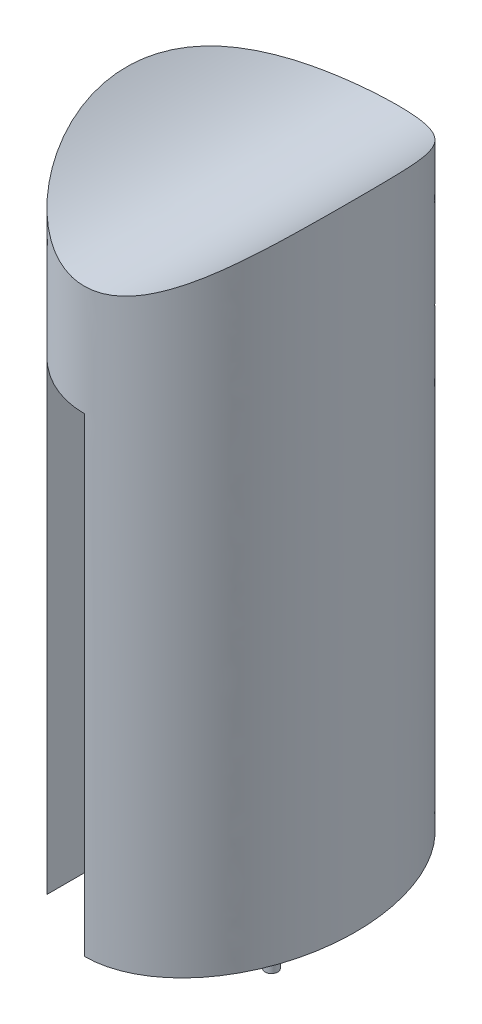
ISO-10303-21;
HEADER;
FILE_DESCRIPTION(('STEP AP214'),'2;1');
FILE_NAME('part.step','',(''),(''),'','','');
FILE_SCHEMA(('AUTOMOTIVE_DESIGN { 1 0 10303 214 1 1 1 1 }'));
ENDSEC;
DATA;
#1=APPLICATION_CONTEXT('core data for automotive mechanical design processes');
#2=APPLICATION_PROTOCOL_DEFINITION('international standard','automotive_design',2000,#1);
#3=PRODUCT_CONTEXT('',#1,'mechanical');
#4=PRODUCT('Part','Part','',(#3));
#5=PRODUCT_RELATED_PRODUCT_CATEGORY('part','',(#4));
#6=PRODUCT_DEFINITION_FORMATION('','',#4);
#7=PRODUCT_DEFINITION_CONTEXT('part definition',#1,'design');
#8=PRODUCT_DEFINITION('design','',#6,#7);
#9=PRODUCT_DEFINITION_SHAPE('','',#8);
#10=(LENGTH_UNIT() NAMED_UNIT(*) SI_UNIT(.MILLI.,.METRE.));
#11=(NAMED_UNIT(*) PLANE_ANGLE_UNIT() SI_UNIT($,.RADIAN.));
#12=(NAMED_UNIT(*) SI_UNIT($,.STERADIAN.) SOLID_ANGLE_UNIT());
#13=UNCERTAINTY_MEASURE_WITH_UNIT(LENGTH_MEASURE(1.E-05),#10,'distance_accuracy_value','');
#14=(GEOMETRIC_REPRESENTATION_CONTEXT(3) GLOBAL_UNCERTAINTY_ASSIGNED_CONTEXT((#13)) GLOBAL_UNIT_ASSIGNED_CONTEXT((#10,
#11,#12)) REPRESENTATION_CONTEXT('',''));
#15=CARTESIAN_POINT('',(0.,0.,0.));
#16=DIRECTION('',(0.,0.,1.));
#17=DIRECTION('',(1.,0.,0.));
#18=AXIS2_PLACEMENT_3D('',#15,#16,#17);
#19=CARTESIAN_POINT('',(95.,240.,130.));
#20=DIRECTION('',(0.,-1.,0.));
#21=DIRECTION('',(1.,0.,0.));
#22=AXIS2_PLACEMENT_3D('',#19,#20,#21);
#23=PLANE('',#22);
#24=CARTESIAN_POINT('',(0.,240.,0.));
#25=DIRECTION('',(0.,1.,0.));
#26=DIRECTION('',(0.,0.,-1.));
#27=AXIS2_PLACEMENT_3D('',#24,#25,#26);
#28=ELLIPSE('',#27,100.,65.);
#29=CARTESIAN_POINT('',(0.,240.,-100.));
#30=VERTEX_POINT('',#29);
#31=EDGE_CURVE('E252',#30,#30,#28,.T.);
#32=ORIENTED_EDGE('',*,*,#31,.F.);
#33=EDGE_LOOP('',(#32));
#34=FACE_BOUND('',#33,.T.);
#35=DIRECTION('',(0.,0.,-1.));
#36=VECTOR('',#35,1.);
#37=CARTESIAN_POINT('',(5.25000000000006,240.,14.75));
#38=LINE('',#37,#36);
#39=CARTESIAN_POINT('',(5.25000000000006,240.,14.75));
#40=VERTEX_POINT('',#39);
#41=CARTESIAN_POINT('',(5.25000000000008,240.,-14.75));
#42=VERTEX_POINT('',#41);
#43=EDGE_CURVE('E184',#40,#42,#38,.T.);
#44=ORIENTED_EDGE('',*,*,#43,.F.);
#45=CARTESIAN_POINT('',(5.25000000000006,240.,20.));
#46=DIRECTION('',(0.,-1.,0.));
#47=DIRECTION('',(1.,0.,0.));
#48=AXIS2_PLACEMENT_3D('',#45,#46,#47);
#49=CIRCLE('',#48,5.25);
#50=CARTESIAN_POINT('',(10.5000000000001,240.,20.));
#51=VERTEX_POINT('',#50);
#52=EDGE_CURVE('E181',#51,#40,#49,.T.);
#53=ORIENTED_EDGE('',*,*,#52,.F.);
#54=DIRECTION('',(-1.,0.,0.));
#55=VECTOR('',#54,1.);
#56=CARTESIAN_POINT('',(40.0000000000001,240.,20.));
#57=LINE('',#56,#55);
#58=CARTESIAN_POINT('',(40.,240.,20.));
#59=VERTEX_POINT('',#58);
#60=EDGE_CURVE('E140',#59,#51,#57,.T.);
#61=ORIENTED_EDGE('',*,*,#60,.F.);
#62=CARTESIAN_POINT('',(45.2500000000001,240.,20.));
#63=DIRECTION('',(0.,-1.,0.));
#64=DIRECTION('',(1.,0.,0.));
#65=AXIS2_PLACEMENT_3D('',#62,#63,#64);
#66=CIRCLE('',#65,5.25);
#67=CARTESIAN_POINT('',(45.2500000000001,240.,14.75));
#68=VERTEX_POINT('',#67);
#69=EDGE_CURVE('E193',#68,#59,#66,.T.);
#70=ORIENTED_EDGE('',*,*,#69,.F.);
#71=DIRECTION('',(0.,0.,1.));
#72=VECTOR('',#71,1.);
#73=CARTESIAN_POINT('',(45.2500000000001,240.,-14.75));
#74=LINE('',#73,#72);
#75=CARTESIAN_POINT('',(45.2500000000001,240.,-14.75));
#76=VERTEX_POINT('',#75);
#77=EDGE_CURVE('E136',#76,#68,#74,.T.);
#78=ORIENTED_EDGE('',*,*,#77,.F.);
#79=CARTESIAN_POINT('',(45.2500000000001,240.,-20.));
#80=DIRECTION('',(0.,-1.,0.));
#81=DIRECTION('',(1.,0.,0.));
#82=AXIS2_PLACEMENT_3D('',#79,#80,#81);
#83=CIRCLE('',#82,5.25);
#84=CARTESIAN_POINT('',(40.0000000000001,240.,-20.));
#85=VERTEX_POINT('',#84);
#86=EDGE_CURVE('E190',#85,#76,#83,.T.);
#87=ORIENTED_EDGE('',*,*,#86,.F.);
#88=DIRECTION('',(1.,0.,0.));
#89=VECTOR('',#88,1.);
#90=CARTESIAN_POINT('',(10.5000000000001,240.,-20.));
#91=LINE('',#90,#89);
#92=CARTESIAN_POINT('',(10.5000000000001,240.,-20.));
#93=VERTEX_POINT('',#92);
#94=EDGE_CURVE('E188',#93,#85,#91,.T.);
#95=ORIENTED_EDGE('',*,*,#94,.F.);
#96=CARTESIAN_POINT('',(5.25000000000008,240.,-20.));
#97=DIRECTION('',(0.,-1.,0.));
#98=DIRECTION('',(1.,0.,0.));
#99=AXIS2_PLACEMENT_3D('',#96,#97,#98);
#100=CIRCLE('',#99,5.25);
#101=EDGE_CURVE('E186',#42,#93,#100,.T.);
#102=ORIENTED_EDGE('',*,*,#101,.F.);
#103=EDGE_LOOP('',(#44,#53,#61,#70,#78,#87,#95,#102));
#104=FACE_BOUND('',#103,.T.);
#105=ADVANCED_FACE('F43',(#34,#104),#23,.T.);
#106=CARTESIAN_POINT('',(0.,-240.,0.));
#107=DIRECTION('',(0.,1.,0.));
#108=DIRECTION('',(0.,0.,1.));
#109=AXIS2_PLACEMENT_3D('',#106,#107,#108);
#110=PLANE('',#109);
#111=CARTESIAN_POINT('',(0.,-240.,0.));
#112=DIRECTION('',(0.,1.,0.));
#113=DIRECTION('',(0.,0.,-1.));
#114=AXIS2_PLACEMENT_3D('',#111,#112,#113);
#115=ELLIPSE('',#114,100.,65.);
#116=CARTESIAN_POINT('',(0.,-240.,100.));
#117=VERTEX_POINT('',#116);
#118=CARTESIAN_POINT('',(-60.,-240.,38.4615384615385));
#119=VERTEX_POINT('',#118);
#120=EDGE_CURVE('E52',#117,#119,#115,.T.);
#121=ORIENTED_EDGE('',*,*,#120,.T.);
#122=DIRECTION('',(0.,0.,-1.));
#123=VECTOR('',#122,1.);
#124=CARTESIAN_POINT('',(-60.,-240.,38.4615384615385));
#125=LINE('',#124,#123);
#126=CARTESIAN_POINT('',(-60.,-240.,100.790504323437));
#127=VERTEX_POINT('',#126);
#128=EDGE_CURVE('E87',#127,#119,#125,.T.);
#129=ORIENTED_EDGE('',*,*,#128,.F.);
#130=CARTESIAN_POINT('',(0.,-240.,0.));
#131=DIRECTION('',(0.,1.,0.));
#132=DIRECTION('',(0.,0.,-1.));
#133=AXIS2_PLACEMENT_3D('',#130,#131,#132);
#134=ELLIPSE('',#133,130.,95.);
#135=CARTESIAN_POINT('',(0.,-240.,130.));
#136=VERTEX_POINT('',#135);
#137=EDGE_CURVE('E11',#136,#127,#134,.T.);
#138=ORIENTED_EDGE('',*,*,#137,.F.);
#139=DIRECTION('',(0.,0.,1.));
#140=VECTOR('',#139,1.);
#141=CARTESIAN_POINT('',(0.,-240.,100.));
#142=LINE('',#141,#140);
#143=EDGE_CURVE('E256',#117,#136,#142,.T.);
#144=ORIENTED_EDGE('',*,*,#143,.F.);
#145=EDGE_LOOP('',(#121,#129,#138,#144));
#146=FACE_BOUND('',#145,.T.);
#147=ADVANCED_FACE('F226',(#146),#110,.F.);
#148=CARTESIAN_POINT('',(0.,240.,0.));
#149=DIRECTION('',(0.,1.,0.));
#150=DIRECTION('',(0.,0.,-1.));
#151=AXIS2_PLACEMENT_3D('',#148,#149,#150);
#152=ELLIPSE('',#151,130.,95.);
#153=DIRECTION('',(0.,-1.,0.));
#154=VECTOR('',#153,1.);
#155=SURFACE_OF_LINEAR_EXTRUSION('',#152,#154);
#156=ORIENTED_EDGE('',*,*,#137,.T.);
#157=DIRECTION('',(0.,-1.,0.));
#158=VECTOR('',#157,1.);
#159=CARTESIAN_POINT('',(-60.,150.,100.790504323437));
#160=LINE('',#159,#158);
#161=CARTESIAN_POINT('',(-60.,150.,100.790504323437));
#162=VERTEX_POINT('',#161);
#163=EDGE_CURVE('E84',#162,#127,#160,.T.);
#164=ORIENTED_EDGE('',*,*,#163,.F.);
#165=CARTESIAN_POINT('',(0.,150.,0.));
#166=DIRECTION('',(0.,-1.,0.));
#167=DIRECTION('',(0.,0.,-1.));
#168=AXIS2_PLACEMENT_3D('',#165,#166,#167);
#169=ELLIPSE('',#168,130.,95.);
#170=CARTESIAN_POINT('',(0.,150.,130.));
#171=VERTEX_POINT('',#170);
#172=EDGE_CURVE('E245',#171,#162,#169,.T.);
#173=ORIENTED_EDGE('',*,*,#172,.F.);
#174=DIRECTION('',(0.,-1.,0.));
#175=VECTOR('',#174,1.);
#176=CARTESIAN_POINT('',(0.,150.,130.));
#177=LINE('',#176,#175);
#178=EDGE_CURVE('E251',#171,#136,#177,.T.);
#179=ORIENTED_EDGE('',*,*,#178,.T.);
#180=EDGE_LOOP('',(#156,#164,#173,#179));
#181=FACE_BOUND('',#180,.T.);
#182=CARTESIAN_POINT('',(-2.35240101925787E-13,241.499999999996,130.));
#183=CARTESIAN_POINT('',(1.20966938572169,241.500004760717,129.999994629393));
#184=CARTESIAN_POINT('',(2.41957041118926,241.521985383448,129.968343258877));
#185=CARTESIAN_POINT('',(4.83528603511733,241.609596967405,129.842050700986));
#186=CARTESIAN_POINT('',(6.04109679626423,241.675261331285,129.74736131172));
#187=CARTESIAN_POINT('',(8.44333523330327,241.849235596756,129.496029768908));
#188=CARTESIAN_POINT('',(9.63976147333455,241.957551899245,129.339378316524));
#189=CARTESIAN_POINT('',(12.0218206138198,242.215508419842,128.96536820721));
#190=CARTESIAN_POINT('',(13.2074165901733,242.365257194989,128.747850056463));
#191=CARTESIAN_POINT('',(15.5605537678426,242.703733101304,128.254607566149));
#192=CARTESIAN_POINT('',(16.728097808293,242.892454034664,127.978892481584));
#193=CARTESIAN_POINT('',(19.0419589451542,243.306288365718,127.371933782026));
#194=CARTESIAN_POINT('',(20.1882776545578,243.531398985268,127.040694405926));
#195=CARTESIAN_POINT('',(22.4461859418871,244.01284443863,126.329041792626));
#196=CARTESIAN_POINT('',(23.558003680778,244.268857635585,125.9491329297));
#197=CARTESIAN_POINT('',(25.7563133149223,244.810897016266,125.140648841815));
#198=CARTESIAN_POINT('',(26.842804660077,245.096923851159,124.712072560967));
#199=CARTESIAN_POINT('',(28.9889693333894,245.696043616958,123.809214067609));
#200=CARTESIAN_POINT('',(30.048642231109,246.009136981928,123.334931122089));
#201=CARTESIAN_POINT('',(32.1396413983561,246.659319569582,122.343784757559));
#202=CARTESIAN_POINT('',(33.1709807104587,246.996397486129,121.826941383376));
#203=CARTESIAN_POINT('',(35.205152348874,247.691841444226,120.75325749903));
#204=CARTESIAN_POINT('',(36.2079861204582,248.050206403635,120.196419021743));
#205=CARTESIAN_POINT('',(38.1848163984488,248.785516262891,119.045346010279));
#206=CARTESIAN_POINT('',(39.1588146286068,249.162460048515,118.451113718123));
#207=CARTESIAN_POINT('',(41.2935119082183,250.018865878326,117.090204616583));
#208=CARTESIAN_POINT('',(42.4470226163056,250.502341769961,116.314768334819));
#209=CARTESIAN_POINT('',(44.7109625999089,251.488944197405,114.715420447035));
#210=CARTESIAN_POINT('',(45.8213953032259,251.992069163279,113.891512711166));
#211=CARTESIAN_POINT('',(47.9992910664205,253.013733813047,112.199139536981));
#212=CARTESIAN_POINT('',(49.0667765513008,253.532265199926,111.330697905477));
#213=CARTESIAN_POINT('',(51.1601562500407,254.581329946959,109.551967781004));
#214=CARTESIAN_POINT('',(52.1860495353696,255.111863574647,108.641678354766));
#215=CARTESIAN_POINT('',(54.1954051380515,256.18067116448,106.783550862413));
#216=CARTESIAN_POINT('',(55.1789344961528,256.71893095379,105.835777045657));
#217=CARTESIAN_POINT('',(57.1062037764129,257.800949738407,103.903701646237));
#218=CARTESIAN_POINT('',(58.0499443203369,258.344708647618,102.919400634822));
#219=CARTESIAN_POINT('',(59.8986997898282,259.434997970841,100.916170287759));
#220=CARTESIAN_POINT('',(60.8037070160355,259.981528911948,99.8972341389413));
#221=CARTESIAN_POINT('',(62.5756361249005,261.074626872766,97.8267646861579));
#222=CARTESIAN_POINT('',(63.4425565695621,261.62119389306,96.7752301539667));
#223=CARTESIAN_POINT('',(65.4329025281342,262.900799578737,94.2716176265072));
#224=CARTESIAN_POINT('',(66.5411707188991,263.632855463051,92.806955087097));
#225=CARTESIAN_POINT('',(68.6916933173497,265.086963325589,89.8250864682077));
#226=CARTESIAN_POINT('',(69.7339436773216,265.809014688296,88.3078771757638));
#227=CARTESIAN_POINT('',(71.7539410663712,267.238039134755,85.2237675093043));
#228=CARTESIAN_POINT('',(72.7316759942151,267.94500937299,83.6568578940946));
#229=CARTESIAN_POINT('',(74.6234849849509,269.33884929497,80.4764287326101));
#230=CARTESIAN_POINT('',(75.5375601973789,270.025719341545,78.8629100287242));
#231=CARTESIAN_POINT('',(77.3024728256512,271.374469894123,75.5925164083549));
#232=CARTESIAN_POINT('',(78.1533383559504,272.036361444846,73.9356612158821));
#233=CARTESIAN_POINT('',(79.7928128799972,273.331105280755,70.5803137792209));
#234=CARTESIAN_POINT('',(80.5814215567515,273.963957418075,68.8818213230858));
#235=CARTESIAN_POINT('',(82.0965835151262,275.19637591729,65.4457423635654));
#236=CARTESIAN_POINT('',(82.8231426223625,275.795945402121,63.7081595496316));
#237=CARTESIAN_POINT('',(84.214339114878,276.957855360655,60.196149360888));
#238=CARTESIAN_POINT('',(84.8789769467017,277.520196102824,58.4217222518931));
#239=CARTESIAN_POINT('',(86.1306080976659,278.590498726669,54.8825749519644));
#240=CARTESIAN_POINT('',(86.7191091685904,279.099457968106,53.1186896260632));
#241=CARTESIAN_POINT('',(87.8367975816972,280.074953485412,49.5606399264344));
#242=CARTESIAN_POINT('',(88.3659850216184,280.541489831186,47.7664756026071));
#243=CARTESIAN_POINT('',(89.3646428506963,281.428950378512,44.1505194604804));
#244=CARTESIAN_POINT('',(89.8341153823559,281.849876216437,42.3287286360148));
#245=CARTESIAN_POINT('',(90.7129019357286,282.643187439688,38.6602345219852));
#246=CARTESIAN_POINT('',(91.1222165539683,283.015573306333,36.8135314796496));
#247=CARTESIAN_POINT('',(91.8613778619019,283.691915358019,33.1903886571207));
#248=CARTESIAN_POINT('',(92.194160216718,283.998350365279,31.415010014634));
#249=CARTESIAN_POINT('',(92.8045056814288,284.562915594941,27.8471589112291));
#250=CARTESIAN_POINT('',(93.0820692312063,284.821046202144,26.0546865866013));
#251=CARTESIAN_POINT('',(93.5815570293701,285.28722721971,22.4556106533539));
#252=CARTESIAN_POINT('',(93.8034838447939,285.495279940612,20.6490077006784));
#253=CARTESIAN_POINT('',(94.1913538935358,285.859867600024,17.0246200770961));
#254=CARTESIAN_POINT('',(94.357297257231,286.016402658512,15.2068354322397));
#255=CARTESIAN_POINT('',(94.6298219697298,286.273925399275,11.6040800897536));
#256=CARTESIAN_POINT('',(94.7376503441205,286.37607934203,9.81928699484481));
#257=CARTESIAN_POINT('',(94.8993394086695,286.529390364204,6.2450738132476));
#258=CARTESIAN_POINT('',(94.9532003502671,286.58054768122,4.45565374815565));
#259=CARTESIAN_POINT('',(95.0068576982156,286.631511453221,0.875280915145285));
#260=CARTESIAN_POINT('',(95.0066543777114,286.63131816764,-0.915671844983889));
#261=CARTESIAN_POINT('',(94.9521843206627,286.579582831431,-4.49601394282351));
#262=CARTESIAN_POINT('',(94.8979175185652,286.528040718542,-6.28540327863564));
#263=CARTESIAN_POINT('',(94.7354252178668,286.373970974923,-9.85937436380789));
#264=CARTESIAN_POINT('',(94.6272043047193,286.271447676987,-11.6439565087654));
#265=CARTESIAN_POINT('',(94.3569958221392,286.016122066968,-15.2054305958825));
#266=CARTESIAN_POINT('',(94.1950082574877,285.863319759358,-16.9823225387261));
#267=CARTESIAN_POINT('',(93.8175366618818,285.508472858271,-20.5254707858618));
#268=CARTESIAN_POINT('',(93.6020525228663,285.306428165328,-22.2917270686629));
#269=CARTESIAN_POINT('',(93.1179235339862,284.854445481335,-25.8107652486936));
#270=CARTESIAN_POINT('',(92.8492786652366,284.604507473271,-27.5635471411362));
#271=CARTESIAN_POINT('',(92.2593179052369,284.058473837392,-31.0522934595082));
#272=CARTESIAN_POINT('',(91.9380213909159,283.762395192273,-32.7882638244461));
#273=CARTESIAN_POINT('',(91.2430916662278,283.125905259845,-36.2414892400943));
#274=CARTESIAN_POINT('',(90.8694584393152,282.78549395852,-37.9587442848877));
#275=CARTESIAN_POINT('',(90.0702535268153,282.062454457428,-41.3721617646198));
#276=CARTESIAN_POINT('',(89.6446811948951,281.679825732311,-43.0683239367883));
#277=CARTESIAN_POINT('',(88.7419788415254,280.874675465044,-46.4372876459094));
#278=CARTESIAN_POINT('',(88.2648488021801,280.452153909048,-48.1100891747533));
#279=CARTESIAN_POINT('',(87.2595465553519,279.569879504913,-51.4296016099378));
#280=CARTESIAN_POINT('',(86.7313935963715,279.110140707579,-53.0763220846372));
#281=CARTESIAN_POINT('',(85.6241458918603,278.1559392731,-56.3423378372935));
#282=CARTESIAN_POINT('',(85.0450511293934,277.66147662441,-57.9616331061325));
#283=CARTESIAN_POINT('',(83.8360969840216,276.640628845834,-61.1708576864329));
#284=CARTESIAN_POINT('',(83.2062396141732,276.114244982029,-62.7607881593225));
#285=CARTESIAN_POINT('',(81.8957737394993,275.032442051541,-65.9095461061639));
#286=CARTESIAN_POINT('',(81.2151652225099,274.477022977898,-67.4683735726608));
#287=CARTESIAN_POINT('',(79.8032330417656,273.340288471033,-70.552851904039));
#288=CARTESIAN_POINT('',(79.0719195456189,272.758978237944,-72.0785093401985));
#289=CARTESIAN_POINT('',(77.5581944490854,271.573503287019,-75.0952059795162));
#290=CARTESIAN_POINT('',(76.7757828063325,270.969338550233,-76.5862451539708));
#291=CARTESIAN_POINT('',(75.1592705953593,269.741312580085,-79.5321836338039));
#292=CARTESIAN_POINT('',(74.3251598921618,269.11744749654,-80.9870757741832));
#293=CARTESIAN_POINT('',(72.60477359246,267.853565887926,-83.8585078151378));
#294=CARTESIAN_POINT('',(71.7184980439502,267.213549377717,-85.2750477509975));
#295=CARTESIAN_POINT('',(69.8923102363172,265.920503175459,-88.0687349706611));
#296=CARTESIAN_POINT('',(68.952359345725,265.267464336629,-89.4458527833767));
#297=CARTESIAN_POINT('',(67.0184003503743,263.952654394182,-92.1573484586057));
#298=CARTESIAN_POINT('',(66.0243918611973,263.290883228492,-93.4917260170742));
#299=CARTESIAN_POINT('',(63.9817810646464,261.963129267657,-96.1143316990759));
#300=CARTESIAN_POINT('',(62.9332133942955,261.297149374802,-97.4025882464066));
#301=CARTESIAN_POINT('',(60.7795636445075,259.964978631815,-99.9308864633242));
#302=CARTESIAN_POINT('',(59.674482827287,259.298787786725,-101.170929208675));
#303=CARTESIAN_POINT('',(57.5810425174981,258.073281296944,-103.412324816389));
#304=CARTESIAN_POINT('',(56.6009241118494,257.513309803074,-104.421021894745));
#305=CARTESIAN_POINT('',(54.5982850139804,256.399850472437,-106.399045938918));
#306=CARTESIAN_POINT('',(53.5757673460454,255.846362176832,-107.368375703026));
#307=CARTESIAN_POINT('',(51.485432309813,254.748276997132,-109.266742474496));
#308=CARTESIAN_POINT('',(50.4175360824741,254.203698076489,-110.195703148372));
#309=CARTESIAN_POINT('',(48.2370584338663,253.128124471277,-112.008535107444));
#310=CARTESIAN_POINT('',(47.1244684355196,252.597132426449,-112.892397663367));
#311=CARTESIAN_POINT('',(45.0644830331667,251.649763485433,-114.451951124847));
#312=CARTESIAN_POINT('',(44.1246945469571,251.230385742466,-115.135860370476));
#313=CARTESIAN_POINT('',(42.214847899327,250.405905732008,-116.469083058626));
#314=CARTESIAN_POINT('',(41.2447881480929,250.000804216674,-117.118394679252));
#315=CARTESIAN_POINT('',(38.2880424617527,248.81044688837,-119.011416057588));
#316=CARTESIAN_POINT('',(36.2549567977623,248.050215921523,-120.200085211997));
#317=CARTESIAN_POINT('',(33.1175264989196,246.978393789572,-121.854677984214));
#318=CARTESIAN_POINT('',(32.0578780615622,246.632764954845,-122.384471374703));
#319=CARTESIAN_POINT('',(29.9091163239285,245.967006028142,-123.398927210118));
#320=CARTESIAN_POINT('',(28.8200014426939,245.646877307969,-123.883587227288));
#321=CARTESIAN_POINT('',(26.6141805440181,245.03549402259,-124.804309109558));
#322=CARTESIAN_POINT('',(25.4974892787394,244.744224419833,-125.24039629925));
#323=CARTESIAN_POINT('',(23.2377871252799,244.193593495199,-126.061003320558));
#324=CARTESIAN_POINT('',(22.0947815859511,243.934225755501,-126.445533525496));
#325=CARTESIAN_POINT('',(19.8975822796689,243.47413889568,-127.124972979853));
#326=CARTESIAN_POINT('',(18.8456431331225,243.270164297506,-127.424970015336));
#327=CARTESIAN_POINT('',(16.7241955853454,242.892869268513,-127.978223932014));
#328=CARTESIAN_POINT('',(15.6546890461505,242.719545611505,-128.231485732485));
#329=CARTESIAN_POINT('',(13.5004771679176,242.405513680915,-128.689252701516));
#330=CARTESIAN_POINT('',(12.4157711480243,242.264806873378,-128.893755678503));
#331=CARTESIAN_POINT('',(10.2361751104086,242.017969788369,-129.251864452697));
#332=CARTESIAN_POINT('',(9.14130799715383,241.911775184009,-129.405564949274));
#333=CARTESIAN_POINT('',(6.94272112263124,241.734964797794,-129.661167856893));
#334=CARTESIAN_POINT('',(5.83900170170025,241.664347654724,-129.76307224969));
#335=CARTESIAN_POINT('',(3.62664190804482,241.559648366548,-129.914073750162));
#336=CARTESIAN_POINT('',(2.51800377281905,241.525551038993,-129.963192802412));
#337=CARTESIAN_POINT('',(0.586017756999367,241.498331497804,-130.002403777021));
#338=CARTESIAN_POINT('',(-0.237000622156709,241.496896055519,-130.004471422115));
#339=CARTESIAN_POINT('',(-1.88220181212598,241.514331491625,-129.97935543073));
#340=CARTESIAN_POINT('',(-2.70438477301791,241.53319763548,-129.952178614358));
#341=CARTESIAN_POINT('',(-4.34645740394271,241.591088303007,-129.868732870772));
#342=CARTESIAN_POINT('',(-5.16634734180624,241.630110364316,-129.812467497184));
#343=CARTESIAN_POINT('',(-6.80260379506205,241.728029113768,-129.671140112347));
#344=CARTESIAN_POINT('',(-7.6189695254409,241.786930019726,-129.58607198983));
#345=CARTESIAN_POINT('',(-9.52974580322079,241.948066336193,-129.353045599489));
#346=CARTESIAN_POINT('',(-10.622099536833,242.05824862408,-129.193504272415));
#347=CARTESIAN_POINT('',(-12.7946996162399,242.312617581268,-128.82428472783));
#348=CARTESIAN_POINT('',(-13.8749408443408,242.456818095688,-128.614586096252));
#349=CARTESIAN_POINT('',(-16.0201122018899,242.777467395889,-128.146883143356));
#350=CARTESIAN_POINT('',(-17.0850414437085,242.953918043132,-127.888876033675));
#351=CARTESIAN_POINT('',(-19.1992139916565,243.337449925262,-127.326062989955));
#352=CARTESIAN_POINT('',(-20.2484209601306,243.54459277263,-127.021162873544));
#353=CARTESIAN_POINT('',(-22.3268298195305,243.987037174744,-126.36721706231));
#354=CARTESIAN_POINT('',(-23.3560332031957,244.222336618892,-126.018174676246));
#355=CARTESIAN_POINT('',(-25.3929456270683,244.718820723499,-125.278248135643));
#356=CARTESIAN_POINT('',(-26.4006530405364,244.980007334621,-124.887360827804));
#357=CARTESIAN_POINT('',(-28.8078070403945,245.639499021727,-123.895248531846));
#358=CARTESIAN_POINT('',(-30.1958669365832,246.049652582482,-123.274158271729));
#359=CARTESIAN_POINT('',(-32.9244243641478,246.910775350229,-121.959069442293));
#360=CARTESIAN_POINT('',(-34.2649030396319,247.361760492389,-121.265042391111));
#361=CARTESIAN_POINT('',(-36.8968494175603,248.298227039432,-119.810222987291));
#362=CARTESIAN_POINT('',(-38.1883097151448,248.783713624638,-119.049420604423));
#363=CARTESIAN_POINT('',(-40.7229053396378,249.783736024094,-117.465918981101));
#364=CARTESIAN_POINT('',(-41.9659914866315,250.298300161239,-116.643159122455));
#365=CARTESIAN_POINT('',(-44.402518422169,251.35049859834,-114.94155860126));
#366=CARTESIAN_POINT('',(-45.5959691554904,251.888128232693,-114.062729262883));
#367=CARTESIAN_POINT('',(-47.9340053753226,252.981512106608,-112.253361631987));
#368=CARTESIAN_POINT('',(-49.0785968712494,253.537264102301,-111.322829731189));
#369=CARTESIAN_POINT('',(-51.4286345331054,254.716965246546,-109.321275641492));
#370=CARTESIAN_POINT('',(-52.6292275411187,255.342303740065,-108.245377945776));
#371=CARTESIAN_POINT('',(-54.9743424607708,256.604016952818,-106.040234684195));
#372=CARTESIAN_POINT('',(-56.1188609884857,257.240392334964,-104.910985906812));
#373=CARTESIAN_POINT('',(-58.3516667326944,258.518361950918,-102.604543278568));
#374=CARTESIAN_POINT('',(-59.44002834598,259.159947904929,-101.427416759228));
#375=CARTESIAN_POINT('',(-61.5635921662644,260.444742537761,-99.0269957141721));
#376=CARTESIAN_POINT('',(-62.5987928803222,261.087951261623,-97.8036998935341));
#377=CARTESIAN_POINT('',(-64.6163241859057,262.371263761323,-95.3149556524071));
#378=CARTESIAN_POINT('',(-65.5987038402954,263.011369897864,-94.0495481804435));
#379=CARTESIAN_POINT('',(-67.5127730708148,264.285293315784,-91.4779416779653));
#380=CARTESIAN_POINT('',(-68.4444631006761,264.919110653413,-90.1717430127446));
#381=CARTESIAN_POINT('',(-70.258449454244,266.177134224472,-87.5202575110208));
#382=CARTESIAN_POINT('',(-71.1407289813901,266.801337137932,-86.1749576157234));
#383=CARTESIAN_POINT('',(-72.8563726877776,268.036576084877,-83.4476335905162));
#384=CARTESIAN_POINT('',(-73.6897367513539,268.647612087225,-82.0656093737795));
#385=CARTESIAN_POINT('',(-75.3078840902059,269.853115453589,-79.2671644643991));
#386=CARTESIAN_POINT('',(-76.0926860342087,270.447589135727,-77.8507572848299));
#387=CARTESIAN_POINT('',(-77.6145435206139,271.617191907827,-74.9847073184892));
#388=CARTESIAN_POINT('',(-78.3515992475039,272.192321072531,-73.5350646601663));
#389=CARTESIAN_POINT('',(-79.7780728288947,273.320161904785,-70.6046087046593));
#390=CARTESIAN_POINT('',(-80.4675057745753,273.872880650826,-69.1238054778104));
#391=CARTESIAN_POINT('',(-81.7991865484499,274.953317942818,-66.1321425204926));
#392=CARTESIAN_POINT('',(-82.4414338801159,275.481036225672,-64.6212824739522));
#393=CARTESIAN_POINT('',(-83.6786933478553,276.508705449893,-61.5713532247472));
#394=CARTESIAN_POINT('',(-84.273713111802,277.008660871393,-60.0322886271173));
#395=CARTESIAN_POINT('',(-85.4165508089443,277.978303302339,-56.9274066754881));
#396=CARTESIAN_POINT('',(-85.9643706911306,278.447991561383,-55.3615904293278));
#397=CARTESIAN_POINT('',(-87.0131438425034,279.35505977357,-52.2034375045185));
#398=CARTESIAN_POINT('',(-87.514055417818,279.792410912957,-50.6110786870324));
#399=CARTESIAN_POINT('',(-88.468293323563,280.632056758448,-47.4027699262197));
#400=CARTESIAN_POINT('',(-88.9216122232102,281.034345988573,-45.7868163437053));
#401=CARTESIAN_POINT('',(-89.9304396764935,281.935738105511,-41.9644971263529));
#402=CARTESIAN_POINT('',(-90.4662558773182,282.419507900266,-39.7492585689244));
#403=CARTESIAN_POINT('',(-91.4497989408204,283.314119601341,-35.2840142688637));
#404=CARTESIAN_POINT('',(-91.8974976233908,283.724938173662,-33.033997651464));
#405=CARTESIAN_POINT('',(-92.7037740773352,284.469135610096,-28.504955822403));
#406=CARTESIAN_POINT('',(-93.0623381004977,284.802502527475,-26.225926192664));
#407=CARTESIAN_POINT('',(-93.6893154551726,285.387947736996,-21.6457353584792));
#408=CARTESIAN_POINT('',(-93.9577526464118,285.64004754268,-19.3445801776413));
#409=CARTESIAN_POINT('',(-94.4038569182461,286.060192351778,-14.726192366426));
#410=CARTESIAN_POINT('',(-94.5815373367928,286.228249706306,-12.4089621492603));
#411=CARTESIAN_POINT('',(-94.8456214791422,286.478371536704,-7.76545847540072));
#412=CARTESIAN_POINT('',(-94.9320583193258,286.56046721183,-5.43918860748964));
#413=CARTESIAN_POINT('',(-95.0049640692347,286.629713164962,-1.27233822545097));
#414=CARTESIAN_POINT('',(-95.0086065691559,286.633174139034,0.567708786324591));
#415=CARTESIAN_POINT('',(-94.9588255220569,286.585888999384,4.2460893219732));
#416=CARTESIAN_POINT('',(-94.9054105727974,286.535151052682,6.08442306223969));
#417=CARTESIAN_POINT('',(-94.7416808823116,286.379897190638,9.75505525108752));
#418=CARTESIAN_POINT('',(-94.6314034938618,286.275416578812,11.5873568679433));
#419=CARTESIAN_POINT('',(-94.3541692020444,286.013450139187,15.2439329786652));
#420=CARTESIAN_POINT('',(-94.187210089142,285.855962245091,17.0682071568016));
#421=CARTESIAN_POINT('',(-93.7969095184331,285.489110816496,20.7054387055632));
#422=CARTESIAN_POINT('',(-93.5735688001541,285.279747962414,22.5183962243035));
#423=CARTESIAN_POINT('',(-93.0708720475969,284.810620286011,26.1299383699837));
#424=CARTESIAN_POINT('',(-92.7915165449329,284.550855942031,27.9285231331615));
#425=CARTESIAN_POINT('',(-92.1771485694966,283.982661743506,31.5087460604157));
#426=CARTESIAN_POINT('',(-91.8421260688667,283.674223121275,33.2903811099225));
#427=CARTESIAN_POINT('',(-91.1168974658317,283.010787610653,36.8336304910415));
#428=CARTESIAN_POINT('',(-90.7266912025823,282.655790586557,38.5952447642829));
#429=CARTESIAN_POINT('',(-89.8917388619467,281.90175261076,42.0949963619263));
#430=CARTESIAN_POINT('',(-89.4470200270263,281.502733668744,43.8331449349761));
#431=CARTESIAN_POINT('',(-88.5032912902069,280.663049576009,47.2844499405403));
#432=CARTESIAN_POINT('',(-88.0042814036018,280.222384437023,48.9976063800949));
#433=CARTESIAN_POINT('',(-86.952349759892,279.302172533175,52.3965505330486));
#434=CARTESIAN_POINT('',(-86.3994319117231,278.82262858789,54.0823402205213));
#435=CARTESIAN_POINT('',(-85.2399064762933,277.827527617804,57.4245600787563));
#436=CARTESIAN_POINT('',(-84.6332988624479,277.311970575172,59.0809902349808));
#437=CARTESIAN_POINT('',(-83.3667573041973,276.248076604719,62.3618960673301));
#438=CARTESIAN_POINT('',(-82.7068423528333,275.699751369943,63.9863828703825));
#439=CARTESIAN_POINT('',(-81.3334991570745,274.573332736781,67.2020698672706));
#440=CARTESIAN_POINT('',(-80.6200708863073,273.995239323725,68.7932700447015));
#441=CARTESIAN_POINT('',(-79.1394072523869,272.812487814082,71.9407631317185));
#442=CARTESIAN_POINT('',(-78.372162144011,272.207824913701,73.4970496514039));
#443=CARTESIAN_POINT('',(-76.7836410016659,270.975483210755,76.5724954747579));
#444=CARTESIAN_POINT('',(-75.9623649656265,270.347804407308,78.0916547770041));
#445=CARTESIAN_POINT('',(-74.2648980815997,269.072771998958,81.0914758793393));
#446=CARTESIAN_POINT('',(-73.3886846951715,268.425410375883,82.5721215217857));
#447=CARTESIAN_POINT('',(-71.5809038641861,267.115043641798,85.4921488782618));
#448=CARTESIAN_POINT('',(-70.6493362563678,266.452038484653,86.9315304705692));
#449=CARTESIAN_POINT('',(-68.7304609308074,265.114781174538,89.7658724548248));
#450=CARTESIAN_POINT('',(-67.7431863077468,264.440535863484,91.1608584668362));
#451=CARTESIAN_POINT('',(-65.7112310359467,263.08466790789,93.9047127547944));
#452=CARTESIAN_POINT('',(-64.6665508279276,262.40304532002,95.2535813846698));
#453=CARTESIAN_POINT('',(-62.6257413343864,261.105244937483,97.7699243125096));
#454=CARTESIAN_POINT('',(-61.6351876859674,260.489331788492,98.942058206385));
#455=CARTESIAN_POINT('',(-59.6054015066205,259.258869380942,101.244049135839));
#456=CARTESIAN_POINT('',(-58.566171948309,258.644320041492,102.373908745528));
#457=CARTESIAN_POINT('',(-56.4357317922176,257.419274607655,104.590726238882));
#458=CARTESIAN_POINT('',(-55.3444250927626,256.80878857823,105.677597459025));
#459=CARTESIAN_POINT('',(-53.1102404726689,255.597247628953,107.803040660834));
#460=CARTESIAN_POINT('',(-51.9673532893627,254.996194429348,108.841603898956));
#461=CARTESIAN_POINT('',(-49.5370249922731,253.761631427586,110.946043334708));
#462=CARTESIAN_POINT('',(-48.2452827811773,253.129284049325,112.007649624218));
#463=CARTESIAN_POINT('',(-45.5989367624913,251.887559804977,114.064712861408));
#464=CARTESIAN_POINT('',(-44.2443195087814,251.278187903268,115.060155547971));
#465=CARTESIAN_POINT('',(-41.4710412244343,250.089619760435,116.978531692111));
#466=CARTESIAN_POINT('',(-40.0523590575502,249.510433615947,117.901440940222));
#467=CARTESIAN_POINT('',(-37.1535728169919,248.391456156727,119.665455929132));
#468=CARTESIAN_POINT('',(-35.6735786546819,247.851598757624,120.506699723043));
#469=CARTESIAN_POINT('',(-32.6511334216316,246.819066942673,122.10062863824));
#470=CARTESIAN_POINT('',(-31.1086990090425,246.326380058919,122.85333717287));
#471=CARTESIAN_POINT('',(-27.9642186444504,245.397643933305,124.260887833781));
#472=CARTESIAN_POINT('',(-26.3622138381207,244.961556499447,124.915795998897));
#473=CARTESIAN_POINT('',(-23.6857053424012,244.299581246049,125.903388673917));
#474=CARTESIAN_POINT('',(-22.6274938569234,244.054302756191,126.267536610205));
#475=CARTESIAN_POINT('',(-20.4897964436046,243.593449050757,126.949153746769));
#476=CARTESIAN_POINT('',(-19.410312496547,243.377871084419,127.266627270055));
#477=CARTESIAN_POINT('',(-17.2320908503489,242.978793223125,127.85247462753));
#478=CARTESIAN_POINT('',(-16.1333508993097,242.795297107906,128.120842676511));
#479=CARTESIAN_POINT('',(-13.9225471986452,242.463095390737,128.605461397327));
#480=CARTESIAN_POINT('',(-12.8105303536666,242.314292113685,128.821858442736));
#481=CARTESIAN_POINT('',(-10.5733832338798,242.05272642299,129.201515424281));
#482=CARTESIAN_POINT('',(-9.44825436943689,241.939960169521,129.364781021726));
#483=CARTESIAN_POINT('',(-7.18891116660863,241.752028020205,129.636531253388));
#484=CARTESIAN_POINT('',(-6.05470327861598,241.676837485287,129.74505178537));
#485=CARTESIAN_POINT('',(-4.50893492567339,241.600815513109,129.854702613542));
#486=CARTESIAN_POINT('',(-4.09976427859289,241.583201687091,129.880099127334));
#487=CARTESIAN_POINT('',(-3.28091770981491,241.552984479357,129.92365837359));
#488=CARTESIAN_POINT('',(-2.87124189576197,241.540380170054,129.941822445247));
#489=CARTESIAN_POINT('',(-2.05143960640132,241.520201812861,129.970897999143));
#490=CARTESIAN_POINT('',(-1.64131306692465,241.512628610741,129.981808261956));
#491=CARTESIAN_POINT('',(-0.820799930029787,241.502526390168,129.99636090329));
#492=CARTESIAN_POINT('',(-0.410413296930449,241.499998384792,130.000001822125));
#493=CARTESIAN_POINT('',(-2.35240101925787E-13,241.499999999996,130.));
#494=B_SPLINE_CURVE_WITH_KNOTS('',3,(#182,#183,#184,#185,#186,#187,#188,#189,#190,#191,#192,
#193,#194,#195,#196,#197,#198,#199,#200,#201,#202,#203,#204,#205,#206,#207,#208,#209,#210,#211,
#212,#213,#214,#215,#216,#217,#218,#219,#220,#221,#222,#223,#224,#225,#226,#227,#228,#229,#230,
#231,#232,#233,#234,#235,#236,#237,#238,#239,#240,#241,#242,#243,#244,#245,#246,#247,#248,#249,
#250,#251,#252,#253,#254,#255,#256,#257,#258,#259,#260,#261,#262,#263,#264,#265,#266,#267,#268,
#269,#270,#271,#272,#273,#274,#275,#276,#277,#278,#279,#280,#281,#282,#283,#284,#285,#286,#287,
#288,#289,#290,#291,#292,#293,#294,#295,#296,#297,#298,#299,#300,#301,#302,#303,#304,#305,#306,
#307,#308,#309,#310,#311,#312,#313,#314,#315,#316,#317,#318,#319,#320,#321,#322,#323,#324,#325,
#326,#327,#328,#329,#330,#331,#332,#333,#334,#335,#336,#337,#338,#339,#340,#341,#342,#343,#344,
#345,#346,#347,#348,#349,#350,#351,#352,#353,#354,#355,#356,#357,#358,#359,#360,#361,#362,#363,
#364,#365,#366,#367,#368,#369,#370,#371,#372,#373,#374,#375,#376,#377,#378,#379,#380,#381,#382,
#383,#384,#385,#386,#387,#388,#389,#390,#391,#392,#393,#394,#395,#396,#397,#398,#399,#400,#401,
#402,#403,#404,#405,#406,#407,#408,#409,#410,#411,#412,#413,#414,#415,#416,#417,#418,#419,#420,
#421,#422,#423,#424,#425,#426,#427,#428,#429,#430,#431,#432,#433,#434,#435,#436,#437,#438,#439,
#440,#441,#442,#443,#444,#445,#446,#447,#448,#449,#450,#451,#452,#453,#454,#455,#456,#457,#458,
#459,#460,#461,#462,#463,#464,#465,#466,#467,#468,#469,#470,#471,#472,#473,#474,#475,#476,#477,
#478,#479,#480,#481,#482,#483,#484,#485,#486,#487,#488,#489,#490,#491,#492,#493),.UNSPECIFIED.,
.T.,.F.,(4,2,2,2,2,2,2,2,2,2,2,2,2,2,2,2,2,2,2,2,2,2,2,2,2,2,2,2,2,2,2,2,2,2,2,2,2,2,2,2,2,2,2,
2,2,2,2,2,2,2,2,2,2,2,2,2,2,2,2,2,2,2,2,2,2,2,2,2,2,2,2,2,2,2,2,2,2,2,2,2,2,2,2,2,2,2,2,2,2,2,2,
2,2,2,2,2,2,2,2,2,2,2,2,2,2,2,2,2,2,2,2,2,2,2,2,2,2,2,2,2,2,2,2,2,2,2,2,2,2,2,2,2,2,2,2,2,2,2,2,
2,2,2,2,2,2,2,2,2,2,2,2,2,2,2,2,4),(0.,3.62880038319235,7.26037871299991,10.8925022518404,
14.5342339218784,18.1753868865106,21.8162620010364,25.4220681560325,29.027952557628,
32.633894797275,36.2381483424692,39.8422188197235,43.4460734134386,47.8591791237935,
52.2719329513853,56.6823519247647,61.0928693049879,65.4961293628063,69.8993205869753,
74.3033830449168,78.7076116390187,84.6372900191166,90.5673316110085,96.4984823641647,
102.429525987709,108.357915603182,114.286335402287,120.214197989618,126.142017824941,
131.924025293853,137.70602323485,143.487813665802,149.269546760579,154.764351827826,
160.259113120729,165.753620842762,171.248115768816,176.619472615611,181.990804436635,
187.362109120483,192.733420317147,198.104275094489,203.47512939424,208.845994543012,
214.21686159977,219.585756483621,224.95465306477,230.323616463541,235.692581725886,
241.059529386165,246.426478830739,251.793215546656,257.159953548869,262.525618481935,
267.891287863789,273.25801246789,278.624732134388,283.995364273841,289.366034610344,
294.733336004858,300.100517573435,304.640959442424,309.181078002726,313.729437804919,
318.278674681718,321.984652980003,325.690826240863,333.103841653061,336.805017919853,
340.506393160604,344.205829478196,347.904520344497,351.241266729561,354.577661693474,
357.914206590839,361.244496390849,364.574658762129,367.903436140925,370.371778482818,
372.839545306846,375.307010725393,377.775000010639,381.101434741825,384.429225645519,
387.757208688439,391.091965284719,394.426472066536,397.761230303245,402.482952053821,
407.206524539765,411.930807765276,416.659774756237,421.387789658062,426.115221354731,
431.300820695022,436.486732585954,441.66558781837,446.844588411423,452.018692299921,
457.192749866489,462.368555752297,467.544373876274,472.718189738828,477.891985608968,
483.064134361571,488.236337532212,493.407703616855,498.578856061568,503.754562041726,
508.931074921932,515.917613549132,522.906382863842,529.896229464825,536.884224147002,
543.871191551882,550.85562220056,556.374179141413,561.891904630091,567.406010149269,
572.920330640853,578.434578807784,583.94877464363,589.463964886213,594.979171204256,
600.491632469142,606.004092181167,611.516152474492,617.028215497119,622.538323198922,
628.048433616236,633.559544400259,639.070655395434,644.584042348122,650.097445562745,
655.607607147249,661.11772643445,666.077386341262,671.036743757734,676.005636481987,
680.975425083278,686.335857514207,691.697441628297,697.060807743311,702.414943315012,
707.767659775127,713.116745357019,716.552428645454,719.987793518205,723.423562857516,
726.849538972763,730.275149920757,733.69851167715,734.929455123104,736.160170535496,
737.391092788926,738.622262186735),.UNSPECIFIED.);
#495=CARTESIAN_POINT('',(-2.35240101925787E-13,241.499999999996,130.));
#496=VERTEX_POINT('',#495);
#497=EDGE_CURVE('E211',#496,#496,#494,.T.);
#498=ORIENTED_EDGE('',*,*,#497,.F.);
#499=EDGE_LOOP('',(#498));
#500=FACE_BOUND('',#499,.T.);
#501=ADVANCED_FACE('F45',(#181,#500),#155,.F.);
#502=DIRECTION('',(0.,-1.,0.));
#503=VECTOR('',#502,1.);
#504=SURFACE_OF_LINEAR_EXTRUSION('',#28,#503);
#505=DIRECTION('',(0.,-1.,0.));
#506=VECTOR('',#505,1.);
#507=CARTESIAN_POINT('',(-60.,150.,38.4615384615385));
#508=LINE('',#507,#506);
#509=CARTESIAN_POINT('',(-60.,150.,38.4615384615385));
#510=VERTEX_POINT('',#509);
#511=EDGE_CURVE('E248',#510,#119,#508,.T.);
#512=ORIENTED_EDGE('',*,*,#511,.T.);
#513=ORIENTED_EDGE('',*,*,#120,.F.);
#514=DIRECTION('',(0.,-1.,0.));
#515=VECTOR('',#514,1.);
#516=CARTESIAN_POINT('',(0.,150.,100.));
#517=LINE('',#516,#515);
#518=CARTESIAN_POINT('',(0.,150.,100.));
#519=VERTEX_POINT('',#518);
#520=EDGE_CURVE('E102',#519,#117,#517,.T.);
#521=ORIENTED_EDGE('',*,*,#520,.F.);
#522=CARTESIAN_POINT('',(0.,150.,0.));
#523=DIRECTION('',(0.,1.,0.));
#524=DIRECTION('',(0.,0.,-1.));
#525=AXIS2_PLACEMENT_3D('',#522,#523,#524);
#526=ELLIPSE('',#525,100.,65.);
#527=EDGE_CURVE('E239',#510,#519,#526,.T.);
#528=ORIENTED_EDGE('',*,*,#527,.F.);
#529=EDGE_LOOP('',(#512,#513,#521,#528));
#530=FACE_BOUND('',#529,.T.);
#531=ORIENTED_EDGE('',*,*,#31,.T.);
#532=EDGE_LOOP('',(#531));
#533=FACE_BOUND('',#532,.T.);
#534=ADVANCED_FACE('F258',(#530,#533),#504,.T.);
#535=CARTESIAN_POINT('',(-60.,150.,38.4615384615385));
#536=DIRECTION('',(-1.,0.,0.));
#537=DIRECTION('',(0.,0.,1.));
#538=AXIS2_PLACEMENT_3D('',#535,#536,#537);
#539=PLANE('',#538);
#540=ORIENTED_EDGE('',*,*,#128,.T.);
#541=ORIENTED_EDGE('',*,*,#511,.F.);
#542=DIRECTION('',(0.,0.,-1.));
#543=VECTOR('',#542,1.);
#544=CARTESIAN_POINT('',(-60.,150.,38.4615384615385));
#545=LINE('',#544,#543);
#546=EDGE_CURVE('E68',#162,#510,#545,.T.);
#547=ORIENTED_EDGE('',*,*,#546,.F.);
#548=ORIENTED_EDGE('',*,*,#163,.T.);
#549=EDGE_LOOP('',(#540,#541,#547,#548));
#550=FACE_BOUND('',#549,.T.);
#551=ADVANCED_FACE('F261',(#550),#539,.F.);
#552=CARTESIAN_POINT('',(0.,150.,100.));
#553=DIRECTION('',(1.,0.,0.));
#554=DIRECTION('',(0.,0.,-1.));
#555=AXIS2_PLACEMENT_3D('',#552,#553,#554);
#556=PLANE('',#555);
#557=ORIENTED_EDGE('',*,*,#143,.T.);
#558=ORIENTED_EDGE('',*,*,#178,.F.);
#559=DIRECTION('',(0.,0.,1.));
#560=VECTOR('',#559,1.);
#561=CARTESIAN_POINT('',(0.,150.,100.));
#562=LINE('',#561,#560);
#563=EDGE_CURVE('E95',#519,#171,#562,.T.);
#564=ORIENTED_EDGE('',*,*,#563,.F.);
#565=ORIENTED_EDGE('',*,*,#520,.T.);
#566=EDGE_LOOP('',(#557,#558,#564,#565));
#567=FACE_BOUND('',#566,.T.);
#568=ADVANCED_FACE('F263',(#567),#556,.F.);
#569=CARTESIAN_POINT('',(0.,150.,0.));
#570=DIRECTION('',(0.,-1.,0.));
#571=DIRECTION('',(0.,0.,-1.));
#572=AXIS2_PLACEMENT_3D('',#569,#570,#571);
#573=PLANE('',#572);
#574=ORIENTED_EDGE('',*,*,#527,.T.);
#575=ORIENTED_EDGE('',*,*,#563,.T.);
#576=ORIENTED_EDGE('',*,*,#172,.T.);
#577=ORIENTED_EDGE('',*,*,#546,.T.);
#578=EDGE_LOOP('',(#574,#575,#576,#577));
#579=FACE_BOUND('',#578,.T.);
#580=ADVANCED_FACE('F232',(#579),#573,.T.);
#581=CARTESIAN_POINT('',(-95.0000000000081,286.625000000008,130.));
#582=CARTESIAN_POINT('',(2.73852121535079E-11,196.374999999992,130.));
#583=CARTESIAN_POINT('',(95.0000000000011,286.624999999993,130.));
#584=B_SPLINE_CURVE_WITH_KNOTS('',2,(#581,#582,#583),.UNSPECIFIED.,.F.,.F.,(3,3),
(0.0685090062716223,0.931490993727996),.UNSPECIFIED.);
#585=DIRECTION('',(0.,0.,-1.));
#586=VECTOR('',#585,1.);
#587=SURFACE_OF_LINEAR_EXTRUSION('',#584,#586);
#588=ORIENTED_EDGE('',*,*,#497,.T.);
#589=EDGE_LOOP('',(#588));
#590=FACE_BOUND('',#589,.T.);
#591=ADVANCED_FACE('F228',(#590),#587,.T.);
#592=CARTESIAN_POINT('',(5.24999999999998,-281.,20.));
#593=DIRECTION('',(0.,1.,0.));
#594=DIRECTION('',(-1.,0.,0.));
#595=AXIS2_PLACEMENT_3D('',#592,#593,#594);
#596=CYLINDRICAL_SURFACE('',#595,5.25);
#597=ORIENTED_EDGE('',*,*,#52,.T.);
#598=DIRECTION('',(0.,1.,0.));
#599=VECTOR('',#598,1.);
#600=CARTESIAN_POINT('',(5.24999999999998,-281.,14.75));
#601=LINE('',#600,#599);
#602=CARTESIAN_POINT('',(5.24999999999998,-281.,14.75));
#603=VERTEX_POINT('',#602);
#604=EDGE_CURVE('E209',#603,#40,#601,.T.);
#605=ORIENTED_EDGE('',*,*,#604,.F.);
#606=CARTESIAN_POINT('',(5.24999999999998,-281.,20.));
#607=DIRECTION('',(0.,-1.,0.));
#608=DIRECTION('',(1.,0.,0.));
#609=AXIS2_PLACEMENT_3D('',#606,#607,#608);
#610=CIRCLE('',#609,5.25);
#611=CARTESIAN_POINT('',(10.5,-281.,20.));
#612=VERTEX_POINT('',#611);
#613=EDGE_CURVE('E196',#612,#603,#610,.T.);
#614=ORIENTED_EDGE('',*,*,#613,.F.);
#615=DIRECTION('',(0.,1.,0.));
#616=VECTOR('',#615,1.);
#617=CARTESIAN_POINT('',(10.5,-281.,20.));
#618=LINE('',#617,#616);
#619=EDGE_CURVE('E177',#612,#51,#618,.T.);
#620=ORIENTED_EDGE('',*,*,#619,.T.);
#621=EDGE_LOOP('',(#597,#605,#614,#620));
#622=FACE_BOUND('',#621,.T.);
#623=ADVANCED_FACE('F223',(#622),#596,.T.);
#624=CARTESIAN_POINT('',(5.24999999999998,-281.,14.75));
#625=DIRECTION('',(1.,0.,0.));
#626=DIRECTION('',(0.,0.,-1.));
#627=AXIS2_PLACEMENT_3D('',#624,#625,#626);
#628=PLANE('',#627);
#629=ORIENTED_EDGE('',*,*,#43,.T.);
#630=DIRECTION('',(0.,1.,0.));
#631=VECTOR('',#630,1.);
#632=CARTESIAN_POINT('',(5.25,-281.,-14.75));
#633=LINE('',#632,#631);
#634=CARTESIAN_POINT('',(5.25,-281.,-14.75));
#635=VERTEX_POINT('',#634);
#636=EDGE_CURVE('E206',#635,#42,#633,.T.);
#637=ORIENTED_EDGE('',*,*,#636,.F.);
#638=DIRECTION('',(0.,0.,-1.));
#639=VECTOR('',#638,1.);
#640=CARTESIAN_POINT('',(5.24999999999998,-281.,14.75));
#641=LINE('',#640,#639);
#642=EDGE_CURVE('E148',#603,#635,#641,.T.);
#643=ORIENTED_EDGE('',*,*,#642,.F.);
#644=ORIENTED_EDGE('',*,*,#604,.T.);
#645=EDGE_LOOP('',(#629,#637,#643,#644));
#646=FACE_BOUND('',#645,.T.);
#647=ADVANCED_FACE('F329',(#646),#628,.F.);
#648=CARTESIAN_POINT('',(5.25,-281.,-20.));
#649=DIRECTION('',(0.,1.,0.));
#650=DIRECTION('',(-1.,0.,0.));
#651=AXIS2_PLACEMENT_3D('',#648,#649,#650);
#652=CYLINDRICAL_SURFACE('',#651,5.25);
#653=ORIENTED_EDGE('',*,*,#101,.T.);
#654=DIRECTION('',(0.,1.,0.));
#655=VECTOR('',#654,1.);
#656=CARTESIAN_POINT('',(10.5,-281.,-20.));
#657=LINE('',#656,#655);
#658=CARTESIAN_POINT('',(10.5,-281.,-20.));
#659=VERTEX_POINT('',#658);
#660=EDGE_CURVE('E203',#659,#93,#657,.T.);
#661=ORIENTED_EDGE('',*,*,#660,.F.);
#662=CARTESIAN_POINT('',(5.25,-281.,-20.));
#663=DIRECTION('',(0.,-1.,0.));
#664=DIRECTION('',(1.,0.,0.));
#665=AXIS2_PLACEMENT_3D('',#662,#663,#664);
#666=CIRCLE('',#665,5.25);
#667=EDGE_CURVE('E500',#635,#659,#666,.T.);
#668=ORIENTED_EDGE('',*,*,#667,.F.);
#669=ORIENTED_EDGE('',*,*,#636,.T.);
#670=EDGE_LOOP('',(#653,#661,#668,#669));
#671=FACE_BOUND('',#670,.T.);
#672=ADVANCED_FACE('F339',(#671),#652,.T.);
#673=CARTESIAN_POINT('',(10.5,-281.,-20.));
#674=DIRECTION('',(0.,0.,1.));
#675=DIRECTION('',(1.,0.,0.));
#676=AXIS2_PLACEMENT_3D('',#673,#674,#675);
#677=PLANE('',#676);
#678=ORIENTED_EDGE('',*,*,#94,.T.);
#679=DIRECTION('',(0.,1.,0.));
#680=VECTOR('',#679,1.);
#681=CARTESIAN_POINT('',(40.,-281.,-20.));
#682=LINE('',#681,#680);
#683=CARTESIAN_POINT('',(40.,-281.,-20.));
#684=VERTEX_POINT('',#683);
#685=EDGE_CURVE('E200',#684,#85,#682,.T.);
#686=ORIENTED_EDGE('',*,*,#685,.F.);
#687=DIRECTION('',(1.,0.,0.));
#688=VECTOR('',#687,1.);
#689=CARTESIAN_POINT('',(10.5,-281.,-20.));
#690=LINE('',#689,#688);
#691=EDGE_CURVE('E504',#659,#684,#690,.T.);
#692=ORIENTED_EDGE('',*,*,#691,.F.);
#693=ORIENTED_EDGE('',*,*,#660,.T.);
#694=EDGE_LOOP('',(#678,#686,#692,#693));
#695=FACE_BOUND('',#694,.T.);
#696=ADVANCED_FACE('F349',(#695),#677,.F.);
#697=CARTESIAN_POINT('',(45.25,-281.,-20.));
#698=DIRECTION('',(0.,1.,0.));
#699=DIRECTION('',(-1.,0.,0.));
#700=AXIS2_PLACEMENT_3D('',#697,#698,#699);
#701=CYLINDRICAL_SURFACE('',#700,5.25);
#702=ORIENTED_EDGE('',*,*,#86,.T.);
#703=DIRECTION('',(0.,1.,0.));
#704=VECTOR('',#703,1.);
#705=CARTESIAN_POINT('',(45.25,-281.,-14.75));
#706=LINE('',#705,#704);
#707=CARTESIAN_POINT('',(45.25,-281.,-14.75));
#708=VERTEX_POINT('',#707);
#709=EDGE_CURVE('E173',#708,#76,#706,.T.);
#710=ORIENTED_EDGE('',*,*,#709,.F.);
#711=CARTESIAN_POINT('',(45.25,-281.,-20.));
#712=DIRECTION('',(0.,-1.,0.));
#713=DIRECTION('',(1.,0.,0.));
#714=AXIS2_PLACEMENT_3D('',#711,#712,#713);
#715=CIRCLE('',#714,5.25);
#716=EDGE_CURVE('E166',#684,#708,#715,.T.);
#717=ORIENTED_EDGE('',*,*,#716,.F.);
#718=ORIENTED_EDGE('',*,*,#685,.T.);
#719=EDGE_LOOP('',(#702,#710,#717,#718));
#720=FACE_BOUND('',#719,.T.);
#721=ADVANCED_FACE('F361',(#720),#701,.T.);
#722=CARTESIAN_POINT('',(45.25,-281.,-14.75));
#723=DIRECTION('',(-1.,0.,0.));
#724=DIRECTION('',(0.,0.,1.));
#725=AXIS2_PLACEMENT_3D('',#722,#723,#724);
#726=PLANE('',#725);
#727=ORIENTED_EDGE('',*,*,#77,.T.);
#728=DIRECTION('',(0.,1.,0.));
#729=VECTOR('',#728,1.);
#730=CARTESIAN_POINT('',(45.25,-281.,14.75));
#731=LINE('',#730,#729);
#732=CARTESIAN_POINT('',(45.25,-281.,14.75));
#733=VERTEX_POINT('',#732);
#734=EDGE_CURVE('E169',#733,#68,#731,.T.);
#735=ORIENTED_EDGE('',*,*,#734,.F.);
#736=DIRECTION('',(0.,0.,1.));
#737=VECTOR('',#736,1.);
#738=CARTESIAN_POINT('',(45.25,-281.,-14.75));
#739=LINE('',#738,#737);
#740=EDGE_CURVE('E161',#708,#733,#739,.T.);
#741=ORIENTED_EDGE('',*,*,#740,.F.);
#742=ORIENTED_EDGE('',*,*,#709,.T.);
#743=EDGE_LOOP('',(#727,#735,#741,#742));
#744=FACE_BOUND('',#743,.T.);
#745=ADVANCED_FACE('F170',(#744),#726,.F.);
#746=CARTESIAN_POINT('',(45.25,-281.,20.));
#747=DIRECTION('',(0.,1.,0.));
#748=DIRECTION('',(-1.,0.,0.));
#749=AXIS2_PLACEMENT_3D('',#746,#747,#748);
#750=CYLINDRICAL_SURFACE('',#749,5.25);
#751=ORIENTED_EDGE('',*,*,#69,.T.);
#752=DIRECTION('',(0.,1.,0.));
#753=VECTOR('',#752,1.);
#754=CARTESIAN_POINT('',(40.,-281.,20.));
#755=LINE('',#754,#753);
#756=CARTESIAN_POINT('',(40.,-281.,20.));
#757=VERTEX_POINT('',#756);
#758=EDGE_CURVE('E59',#757,#59,#755,.T.);
#759=ORIENTED_EDGE('',*,*,#758,.F.);
#760=CARTESIAN_POINT('',(45.25,-281.,20.));
#761=DIRECTION('',(0.,-1.,0.));
#762=DIRECTION('',(1.,0.,0.));
#763=AXIS2_PLACEMENT_3D('',#760,#761,#762);
#764=CIRCLE('',#763,5.25);
#765=EDGE_CURVE('E164',#733,#757,#764,.T.);
#766=ORIENTED_EDGE('',*,*,#765,.F.);
#767=ORIENTED_EDGE('',*,*,#734,.T.);
#768=EDGE_LOOP('',(#751,#759,#766,#767));
#769=FACE_BOUND('',#768,.T.);
#770=ADVANCED_FACE('F175',(#769),#750,.T.);
#771=CARTESIAN_POINT('',(40.,-281.,20.));
#772=DIRECTION('',(0.,0.,-1.));
#773=DIRECTION('',(-1.,0.,0.));
#774=AXIS2_PLACEMENT_3D('',#771,#772,#773);
#775=PLANE('',#774);
#776=ORIENTED_EDGE('',*,*,#60,.T.);
#777=ORIENTED_EDGE('',*,*,#619,.F.);
#778=DIRECTION('',(-1.,0.,0.));
#779=VECTOR('',#778,1.);
#780=CARTESIAN_POINT('',(40.,-281.,20.));
#781=LINE('',#780,#779);
#782=EDGE_CURVE('E110',#757,#612,#781,.T.);
#783=ORIENTED_EDGE('',*,*,#782,.F.);
#784=ORIENTED_EDGE('',*,*,#758,.T.);
#785=EDGE_LOOP('',(#776,#777,#783,#784));
#786=FACE_BOUND('',#785,.T.);
#787=ADVANCED_FACE('F394',(#786),#775,.F.);
#788=CARTESIAN_POINT('',(5.24999999999998,-281.,20.));
#789=DIRECTION('',(0.,-1.,0.));
#790=DIRECTION('',(1.,0.,0.));
#791=AXIS2_PLACEMENT_3D('',#788,#789,#790);
#792=PLANE('',#791);
#793=ORIENTED_EDGE('',*,*,#613,.T.);
#794=ORIENTED_EDGE('',*,*,#642,.T.);
#795=ORIENTED_EDGE('',*,*,#667,.T.);
#796=ORIENTED_EDGE('',*,*,#691,.T.);
#797=ORIENTED_EDGE('',*,*,#716,.T.);
#798=ORIENTED_EDGE('',*,*,#740,.T.);
#799=ORIENTED_EDGE('',*,*,#765,.T.);
#800=ORIENTED_EDGE('',*,*,#782,.T.);
#801=EDGE_LOOP('',(#793,#794,#795,#796,#797,#798,#799,#800));
#802=FACE_BOUND('',#801,.T.);
#803=ADVANCED_FACE('F162',(#802),#792,.T.);
#804=CLOSED_SHELL('',(#105,#147,#501,#534,#551,#568,#580,#591,#623,#647,#672,#696,#721,#745,
#770,#787,#803));
#805=MANIFOLD_SOLID_BREP('B2',#804);
#806=ADVANCED_BREP_SHAPE_REPRESENTATION('',(#18,#805),#14);
#807=SHAPE_DEFINITION_REPRESENTATION(#9,#806);
ENDSEC;
END-ISO-10303-21;
